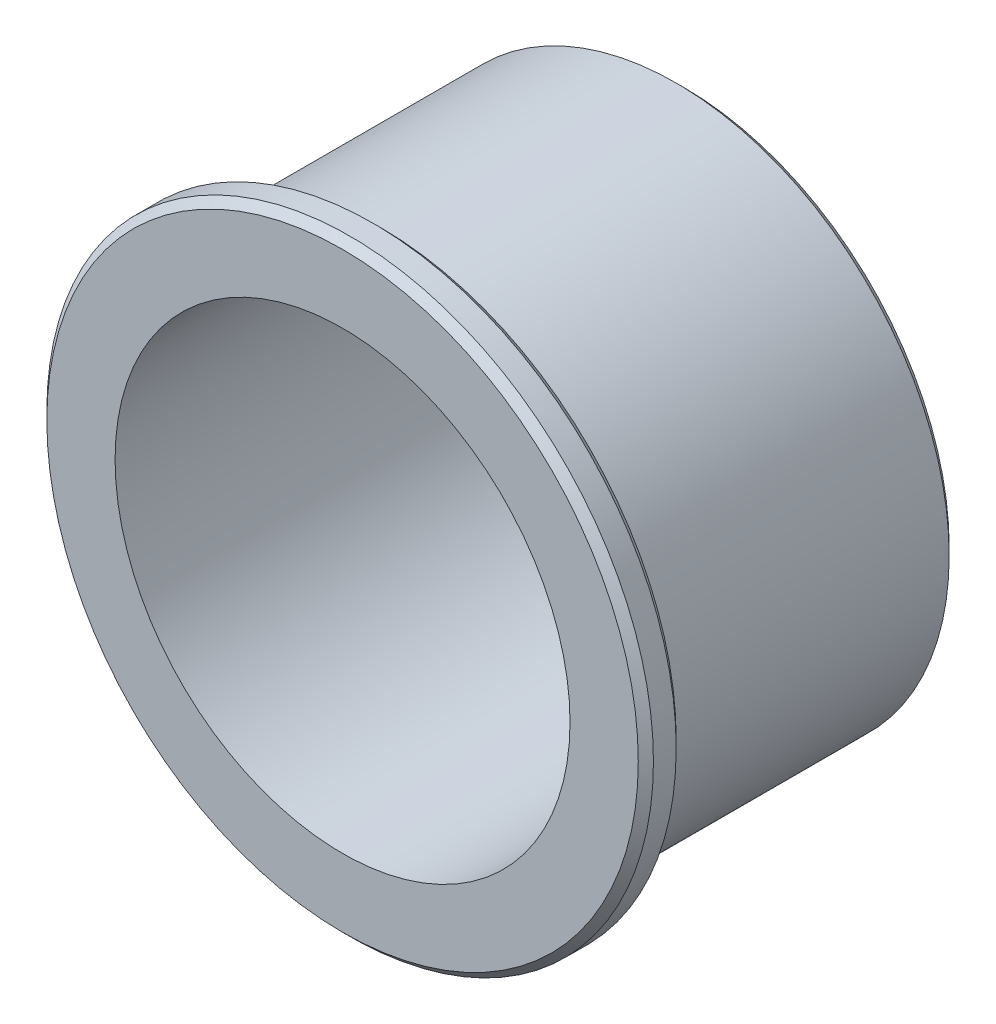
ISO-10303-21;
HEADER;
FILE_DESCRIPTION(('STEP AP214'),'2;1');
FILE_NAME('part.step','',(''),(''),'','','');
FILE_SCHEMA(('AUTOMOTIVE_DESIGN { 1 0 10303 214 1 1 1 1 }'));
ENDSEC;
DATA;
#1=APPLICATION_CONTEXT('core data for automotive mechanical design processes');
#2=APPLICATION_PROTOCOL_DEFINITION('international standard','automotive_design',2000,#1);
#3=PRODUCT_CONTEXT('',#1,'mechanical');
#4=PRODUCT('Part','Part','',(#3));
#5=PRODUCT_RELATED_PRODUCT_CATEGORY('part','',(#4));
#6=PRODUCT_DEFINITION_FORMATION('','',#4);
#7=PRODUCT_DEFINITION_CONTEXT('part definition',#1,'design');
#8=PRODUCT_DEFINITION('design','',#6,#7);
#9=PRODUCT_DEFINITION_SHAPE('','',#8);
#10=(LENGTH_UNIT() NAMED_UNIT(*) SI_UNIT(.MILLI.,.METRE.));
#11=(NAMED_UNIT(*) PLANE_ANGLE_UNIT() SI_UNIT($,.RADIAN.));
#12=(NAMED_UNIT(*) SI_UNIT($,.STERADIAN.) SOLID_ANGLE_UNIT());
#13=UNCERTAINTY_MEASURE_WITH_UNIT(LENGTH_MEASURE(1.E-05),#10,'distance_accuracy_value','');
#14=(GEOMETRIC_REPRESENTATION_CONTEXT(3) GLOBAL_UNCERTAINTY_ASSIGNED_CONTEXT((#13)) GLOBAL_UNIT_ASSIGNED_CONTEXT((#10,
#11,#12)) REPRESENTATION_CONTEXT('',''));
#15=CARTESIAN_POINT('',(0.,0.,0.));
#16=DIRECTION('',(0.,0.,1.));
#17=DIRECTION('',(1.,0.,0.));
#18=AXIS2_PLACEMENT_3D('',#15,#16,#17);
#19=CARTESIAN_POINT('',(0.,0.,38.9834782608696));
#20=DIRECTION('',(0.,0.,1.));
#21=DIRECTION('',(1.,0.,0.));
#22=AXIS2_PLACEMENT_3D('',#19,#20,#21);
#23=CYLINDRICAL_SURFACE('',#22,15.);
#24=CARTESIAN_POINT('',(0.,0.,-22.));
#25=DIRECTION('',(0.,0.,1.));
#26=DIRECTION('',(1.,0.,0.));
#27=AXIS2_PLACEMENT_3D('',#24,#25,#26);
#28=CIRCLE('',#27,15.);
#29=CARTESIAN_POINT('',(15.,0.,-22.));
#30=VERTEX_POINT('',#29);
#31=EDGE_CURVE('E40',#30,#30,#28,.F.);
#32=ORIENTED_EDGE('',*,*,#31,.T.);
#33=EDGE_LOOP('',(#32));
#34=FACE_BOUND('',#33,.T.);
#35=CARTESIAN_POINT('',(0.,0.,0.));
#36=DIRECTION('',(0.,0.,1.));
#37=DIRECTION('',(1.,0.,0.));
#38=AXIS2_PLACEMENT_3D('',#35,#36,#37);
#39=CIRCLE('',#38,15.);
#40=CARTESIAN_POINT('',(15.,0.,0.));
#41=VERTEX_POINT('',#40);
#42=EDGE_CURVE('E67',#41,#41,#39,.T.);
#43=ORIENTED_EDGE('',*,*,#42,.T.);
#44=EDGE_LOOP('',(#43));
#45=FACE_BOUND('',#44,.T.);
#46=ADVANCED_FACE('F30',(#34,#45),#23,.F.);
#47=CARTESIAN_POINT('',(0.,15.,0.));
#48=DIRECTION('',(0.,0.,-1.));
#49=DIRECTION('',(-1.,0.,0.));
#50=AXIS2_PLACEMENT_3D('',#47,#48,#49);
#51=PLANE('',#50);
#52=CARTESIAN_POINT('',(0.,0.,0.));
#53=DIRECTION('',(0.,0.,-1.));
#54=DIRECTION('',(-1.,0.,0.));
#55=AXIS2_PLACEMENT_3D('',#52,#53,#54);
#56=CIRCLE('',#55,19.5);
#57=CARTESIAN_POINT('',(-19.5,0.,0.));
#58=VERTEX_POINT('',#57);
#59=EDGE_CURVE('E58',#58,#58,#56,.F.);
#60=ORIENTED_EDGE('',*,*,#59,.T.);
#61=EDGE_LOOP('',(#60));
#62=FACE_BOUND('',#61,.T.);
#63=ORIENTED_EDGE('',*,*,#42,.F.);
#64=EDGE_LOOP('',(#63));
#65=FACE_BOUND('',#64,.T.);
#66=ADVANCED_FACE('F72',(#62,#65),#51,.F.);
#67=CARTESIAN_POINT('',(0.,0.,38.9834782608696));
#68=DIRECTION('',(0.,0.,1.));
#69=DIRECTION('',(1.,0.,0.));
#70=AXIS2_PLACEMENT_3D('',#67,#68,#69);
#71=CYLINDRICAL_SURFACE('',#70,20.);
#72=CARTESIAN_POINT('',(0.,0.,-0.5));
#73=DIRECTION('',(0.,0.,-1.));
#74=DIRECTION('',(-1.,0.,0.));
#75=AXIS2_PLACEMENT_3D('',#72,#73,#74);
#76=CIRCLE('',#75,20.);
#77=CARTESIAN_POINT('',(-20.,0.,-0.5));
#78=VERTEX_POINT('',#77);
#79=EDGE_CURVE('E52',#78,#78,#76,.T.);
#80=ORIENTED_EDGE('',*,*,#79,.T.);
#81=EDGE_LOOP('',(#80));
#82=FACE_BOUND('',#81,.T.);
#83=CARTESIAN_POINT('',(0.,0.,-2.));
#84=DIRECTION('',(0.,0.,1.));
#85=DIRECTION('',(1.,0.,0.));
#86=AXIS2_PLACEMENT_3D('',#83,#84,#85);
#87=CIRCLE('',#86,20.);
#88=CARTESIAN_POINT('',(20.,0.,-2.));
#89=VERTEX_POINT('',#88);
#90=EDGE_CURVE('E55',#89,#89,#87,.T.);
#91=ORIENTED_EDGE('',*,*,#90,.T.);
#92=EDGE_LOOP('',(#91));
#93=FACE_BOUND('',#92,.T.);
#94=ADVANCED_FACE('F74',(#82,#93),#71,.T.);
#95=CARTESIAN_POINT('',(0.,20.,-2.5));
#96=DIRECTION('',(0.,0.,1.));
#97=DIRECTION('',(1.,0.,0.));
#98=AXIS2_PLACEMENT_3D('',#95,#96,#97);
#99=PLANE('',#98);
#100=CARTESIAN_POINT('',(0.,0.,-2.5));
#101=DIRECTION('',(0.,0.,1.));
#102=DIRECTION('',(1.,0.,0.));
#103=AXIS2_PLACEMENT_3D('',#100,#101,#102);
#104=CIRCLE('',#103,19.5);
#105=CARTESIAN_POINT('',(19.5,0.,-2.5));
#106=VERTEX_POINT('',#105);
#107=EDGE_CURVE('E10',#106,#106,#104,.F.);
#108=ORIENTED_EDGE('',*,*,#107,.T.);
#109=EDGE_LOOP('',(#108));
#110=FACE_BOUND('',#109,.T.);
#111=CARTESIAN_POINT('',(0.,0.,-2.5));
#112=DIRECTION('',(0.,0.,1.));
#113=DIRECTION('',(1.,0.,0.));
#114=AXIS2_PLACEMENT_3D('',#111,#112,#113);
#115=CIRCLE('',#114,18.5);
#116=CARTESIAN_POINT('',(18.5,0.,-2.5));
#117=VERTEX_POINT('',#116);
#118=EDGE_CURVE('E64',#117,#117,#115,.T.);
#119=ORIENTED_EDGE('',*,*,#118,.T.);
#120=EDGE_LOOP('',(#119));
#121=FACE_BOUND('',#120,.T.);
#122=ADVANCED_FACE('F80',(#110,#121),#99,.F.);
#123=CARTESIAN_POINT('',(0.,0.,38.9834782608696));
#124=DIRECTION('',(0.,0.,1.));
#125=DIRECTION('',(1.,0.,0.));
#126=AXIS2_PLACEMENT_3D('',#123,#124,#125);
#127=CYLINDRICAL_SURFACE('',#126,18.);
#128=CARTESIAN_POINT('',(0.,0.,-22.));
#129=DIRECTION('',(0.,0.,1.));
#130=DIRECTION('',(1.,0.,0.));
#131=AXIS2_PLACEMENT_3D('',#128,#129,#130);
#132=CIRCLE('',#131,18.);
#133=CARTESIAN_POINT('',(18.,0.,-22.));
#134=VERTEX_POINT('',#133);
#135=EDGE_CURVE('E36',#134,#134,#132,.T.);
#136=ORIENTED_EDGE('',*,*,#135,.T.);
#137=EDGE_LOOP('',(#136));
#138=FACE_BOUND('',#137,.T.);
#139=CARTESIAN_POINT('',(0.,0.,-3.));
#140=DIRECTION('',(0.,0.,1.));
#141=DIRECTION('',(1.,0.,0.));
#142=AXIS2_PLACEMENT_3D('',#139,#140,#141);
#143=CIRCLE('',#142,18.);
#144=CARTESIAN_POINT('',(18.,0.,-3.));
#145=VERTEX_POINT('',#144);
#146=EDGE_CURVE('E61',#145,#145,#143,.F.);
#147=ORIENTED_EDGE('',*,*,#146,.T.);
#148=EDGE_LOOP('',(#147));
#149=FACE_BOUND('',#148,.T.);
#150=ADVANCED_FACE('F87',(#138,#149),#127,.T.);
#151=CARTESIAN_POINT('',(0.,18.,-22.5));
#152=DIRECTION('',(0.,0.,1.));
#153=DIRECTION('',(1.,0.,0.));
#154=AXIS2_PLACEMENT_3D('',#151,#152,#153);
#155=PLANE('',#154);
#156=CARTESIAN_POINT('',(0.,0.,-22.5));
#157=DIRECTION('',(0.,0.,1.));
#158=DIRECTION('',(1.,0.,0.));
#159=AXIS2_PLACEMENT_3D('',#156,#157,#158);
#160=CIRCLE('',#159,15.5);
#161=CARTESIAN_POINT('',(15.5,0.,-22.5));
#162=VERTEX_POINT('',#161);
#163=EDGE_CURVE('E44',#162,#162,#160,.T.);
#164=ORIENTED_EDGE('',*,*,#163,.T.);
#165=EDGE_LOOP('',(#164));
#166=FACE_BOUND('',#165,.T.);
#167=CARTESIAN_POINT('',(0.,0.,-22.5));
#168=DIRECTION('',(0.,0.,1.));
#169=DIRECTION('',(1.,0.,0.));
#170=AXIS2_PLACEMENT_3D('',#167,#168,#169);
#171=CIRCLE('',#170,17.5);
#172=CARTESIAN_POINT('',(17.5,0.,-22.5));
#173=VERTEX_POINT('',#172);
#174=EDGE_CURVE('E49',#173,#173,#171,.F.);
#175=ORIENTED_EDGE('',*,*,#174,.T.);
#176=EDGE_LOOP('',(#175));
#177=FACE_BOUND('',#176,.T.);
#178=ADVANCED_FACE('F90',(#166,#177),#155,.F.);
#179=CARTESIAN_POINT('',(0.,0.,-3.));
#180=DIRECTION('',(0.,0.,1.));
#181=DIRECTION('',(1.,0.,0.));
#182=AXIS2_PLACEMENT_3D('',#179,#180,#181);
#183=TOROIDAL_SURFACE('',#182,18.5,0.5);
#184=ORIENTED_EDGE('',*,*,#146,.F.);
#185=EDGE_LOOP('',(#184));
#186=FACE_BOUND('',#185,.T.);
#187=ORIENTED_EDGE('',*,*,#118,.F.);
#188=EDGE_LOOP('',(#187));
#189=FACE_BOUND('',#188,.T.);
#190=ADVANCED_FACE('F93',(#186,#189),#183,.F.);
#191=CARTESIAN_POINT('',(0.,0.,0.));
#192=DIRECTION('',(0.,0.,-1.));
#193=DIRECTION('',(-1.,0.,0.));
#194=AXIS2_PLACEMENT_3D('',#191,#192,#193);
#195=CONICAL_SURFACE('',#194,19.5,0.785398163397445);
#196=ORIENTED_EDGE('',*,*,#79,.F.);
#197=EDGE_LOOP('',(#196));
#198=FACE_BOUND('',#197,.T.);
#199=ORIENTED_EDGE('',*,*,#59,.F.);
#200=EDGE_LOOP('',(#199));
#201=FACE_BOUND('',#200,.T.);
#202=ADVANCED_FACE('F97',(#198,#201),#195,.T.);
#203=CARTESIAN_POINT('',(0.,0.,-22.5));
#204=DIRECTION('',(0.,0.,-1.));
#205=DIRECTION('',(-1.,0.,0.));
#206=AXIS2_PLACEMENT_3D('',#203,#204,#205);
#207=CONICAL_SURFACE('',#206,15.5,0.785398163397445);
#208=ORIENTED_EDGE('',*,*,#31,.F.);
#209=EDGE_LOOP('',(#208));
#210=FACE_BOUND('',#209,.T.);
#211=ORIENTED_EDGE('',*,*,#163,.F.);
#212=EDGE_LOOP('',(#211));
#213=FACE_BOUND('',#212,.T.);
#214=ADVANCED_FACE('F101',(#210,#213),#207,.F.);
#215=CARTESIAN_POINT('',(0.,0.,-22.));
#216=DIRECTION('',(0.,0.,1.));
#217=DIRECTION('',(1.,0.,0.));
#218=AXIS2_PLACEMENT_3D('',#215,#216,#217);
#219=CONICAL_SURFACE('',#218,18.,0.785398163397455);
#220=ORIENTED_EDGE('',*,*,#174,.F.);
#221=EDGE_LOOP('',(#220));
#222=FACE_BOUND('',#221,.T.);
#223=ORIENTED_EDGE('',*,*,#135,.F.);
#224=EDGE_LOOP('',(#223));
#225=FACE_BOUND('',#224,.T.);
#226=ADVANCED_FACE('F105',(#222,#225),#219,.T.);
#227=CARTESIAN_POINT('',(0.,0.,-2.));
#228=DIRECTION('',(0.,0.,1.));
#229=DIRECTION('',(1.,0.,0.));
#230=AXIS2_PLACEMENT_3D('',#227,#228,#229);
#231=CONICAL_SURFACE('',#230,20.,0.785398163397445);
#232=ORIENTED_EDGE('',*,*,#107,.F.);
#233=EDGE_LOOP('',(#232));
#234=FACE_BOUND('',#233,.T.);
#235=ORIENTED_EDGE('',*,*,#90,.F.);
#236=EDGE_LOOP('',(#235));
#237=FACE_BOUND('',#236,.T.);
#238=ADVANCED_FACE('F109',(#234,#237),#231,.T.);
#239=CLOSED_SHELL('',(#46,#66,#94,#122,#150,#178,#190,#202,#214,#226,#238));
#240=MANIFOLD_SOLID_BREP('B2',#239);
#241=ADVANCED_BREP_SHAPE_REPRESENTATION('',(#18,#240),#14);
#242=SHAPE_DEFINITION_REPRESENTATION(#9,#241);
ENDSEC;
END-ISO-10303-21;
